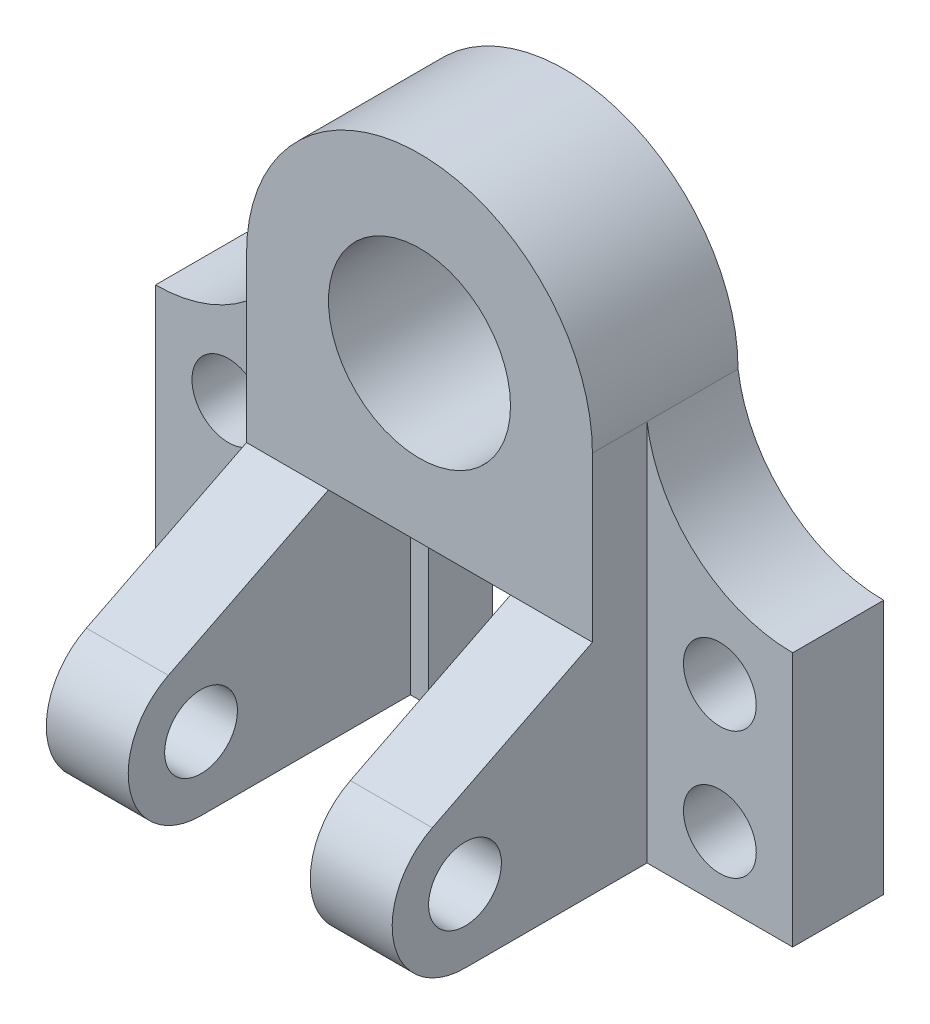
ISO-10303-21;
HEADER;
FILE_DESCRIPTION(('STEP AP214'),'2;1');
FILE_NAME('part.step','',(''),(''),'','','');
FILE_SCHEMA(('AUTOMOTIVE_DESIGN { 1 0 10303 214 1 1 1 1 }'));
ENDSEC;
DATA;
#1=APPLICATION_CONTEXT('core data for automotive mechanical design processes');
#2=APPLICATION_PROTOCOL_DEFINITION('international standard','automotive_design',2000,#1);
#3=PRODUCT_CONTEXT('',#1,'mechanical');
#4=PRODUCT('Part','Part','',(#3));
#5=PRODUCT_RELATED_PRODUCT_CATEGORY('part','',(#4));
#6=PRODUCT_DEFINITION_FORMATION('','',#4);
#7=PRODUCT_DEFINITION_CONTEXT('part definition',#1,'design');
#8=PRODUCT_DEFINITION('design','',#6,#7);
#9=PRODUCT_DEFINITION_SHAPE('','',#8);
#10=(LENGTH_UNIT() NAMED_UNIT(*) SI_UNIT(.MILLI.,.METRE.));
#11=(NAMED_UNIT(*) PLANE_ANGLE_UNIT() SI_UNIT($,.RADIAN.));
#12=(NAMED_UNIT(*) SI_UNIT($,.STERADIAN.) SOLID_ANGLE_UNIT());
#13=UNCERTAINTY_MEASURE_WITH_UNIT(LENGTH_MEASURE(1.E-05),#10,'distance_accuracy_value','');
#14=(GEOMETRIC_REPRESENTATION_CONTEXT(3) GLOBAL_UNCERTAINTY_ASSIGNED_CONTEXT((#13)) GLOBAL_UNIT_ASSIGNED_CONTEXT((#10,
#11,#12)) REPRESENTATION_CONTEXT('',''));
#15=CARTESIAN_POINT('',(0.,0.,0.));
#16=DIRECTION('',(0.,0.,1.));
#17=DIRECTION('',(1.,0.,0.));
#18=AXIS2_PLACEMENT_3D('',#15,#16,#17);
#19=CARTESIAN_POINT('',(-38.,-36.,32.));
#20=DIRECTION('',(0.,1.,0.));
#21=DIRECTION('',(0.,0.,1.));
#22=AXIS2_PLACEMENT_3D('',#19,#20,#21);
#23=PLANE('',#22);
#24=DIRECTION('',(0.,0.,1.));
#25=VECTOR('',#24,1.);
#26=CARTESIAN_POINT('',(16.,-36.,0.));
#27=LINE('',#26,#25);
#28=CARTESIAN_POINT('',(16.,-36.,0.));
#29=VERTEX_POINT('',#28);
#30=CARTESIAN_POINT('',(16.,-36.,14.));
#31=VERTEX_POINT('',#30);
#32=EDGE_CURVE('E48',#29,#31,#27,.T.);
#33=ORIENTED_EDGE('',*,*,#32,.T.);
#34=DIRECTION('',(1.,0.,0.));
#35=VECTOR('',#34,1.);
#36=CARTESIAN_POINT('',(16.,-36.,14.));
#37=LINE('',#36,#35);
#38=CARTESIAN_POINT('',(20.,-36.,14.));
#39=VERTEX_POINT('',#38);
#40=EDGE_CURVE('E199',#31,#39,#37,.T.);
#41=ORIENTED_EDGE('',*,*,#40,.T.);
#42=DIRECTION('',(0.,0.,1.));
#43=VECTOR('',#42,1.);
#44=CARTESIAN_POINT('',(20.,-36.,0.));
#45=LINE('',#44,#43);
#46=CARTESIAN_POINT('',(20.,-36.,32.));
#47=VERTEX_POINT('',#46);
#48=EDGE_CURVE('E219',#39,#47,#45,.T.);
#49=ORIENTED_EDGE('',*,*,#48,.T.);
#50=DIRECTION('',(1.,0.,0.));
#51=VECTOR('',#50,1.);
#52=CARTESIAN_POINT('',(-38.,-36.,32.));
#53=LINE('',#52,#51);
#54=CARTESIAN_POINT('',(-20.,-36.,32.));
#55=VERTEX_POINT('',#54);
#56=EDGE_CURVE('E365',#55,#47,#53,.T.);
#57=ORIENTED_EDGE('',*,*,#56,.F.);
#58=DIRECTION('',(0.,0.,1.));
#59=VECTOR('',#58,1.);
#60=CARTESIAN_POINT('',(-20.,-36.,0.));
#61=LINE('',#60,#59);
#62=CARTESIAN_POINT('',(-20.,-36.,14.));
#63=VERTEX_POINT('',#62);
#64=EDGE_CURVE('E262',#63,#55,#61,.T.);
#65=ORIENTED_EDGE('',*,*,#64,.F.);
#66=DIRECTION('',(-1.,0.,0.));
#67=VECTOR('',#66,1.);
#68=CARTESIAN_POINT('',(-16.,-36.,14.));
#69=LINE('',#68,#67);
#70=CARTESIAN_POINT('',(-16.,-36.,14.));
#71=VERTEX_POINT('',#70);
#72=EDGE_CURVE('E252',#71,#63,#69,.T.);
#73=ORIENTED_EDGE('',*,*,#72,.F.);
#74=DIRECTION('',(0.,0.,1.));
#75=VECTOR('',#74,1.);
#76=CARTESIAN_POINT('',(-16.,-36.,0.));
#77=LINE('',#76,#75);
#78=CARTESIAN_POINT('',(-16.,-36.,0.));
#79=VERTEX_POINT('',#78);
#80=EDGE_CURVE('E239',#79,#71,#77,.T.);
#81=ORIENTED_EDGE('',*,*,#80,.F.);
#82=DIRECTION('',(1.,0.,0.));
#83=VECTOR('',#82,1.);
#84=CARTESIAN_POINT('',(-38.,-36.,0.));
#85=LINE('',#84,#83);
#86=EDGE_CURVE('E53',#79,#29,#85,.T.);
#87=ORIENTED_EDGE('',*,*,#86,.T.);
#88=EDGE_LOOP('',(#33,#41,#49,#57,#65,#73,#81,#87));
#89=FACE_BOUND('',#88,.T.);
#90=ADVANCED_FACE('F33',(#89),#23,.F.);
#91=CARTESIAN_POINT('',(-20.,-68.,60.));
#92=DIRECTION('',(1.,0.,0.));
#93=DIRECTION('',(0.,1.,0.));
#94=AXIS2_PLACEMENT_3D('',#91,#92,#93);
#95=PLANE('',#94);
#96=CARTESIAN_POINT('',(-20.,-68.,60.));
#97=DIRECTION('',(1.,0.,0.));
#98=DIRECTION('',(0.,1.,0.));
#99=AXIS2_PLACEMENT_3D('',#96,#97,#98);
#100=CIRCLE('',#99,8.);
#101=CARTESIAN_POINT('',(-20.,-60.,60.));
#102=VERTEX_POINT('',#101);
#103=EDGE_CURVE('E256',#102,#102,#100,.T.);
#104=ORIENTED_EDGE('',*,*,#103,.F.);
#105=EDGE_LOOP('',(#104));
#106=FACE_BOUND('',#105,.T.);
#107=DIRECTION('',(0.,0.,-1.));
#108=VECTOR('',#107,1.);
#109=CARTESIAN_POINT('',(-20.,-84.,0.));
#110=LINE('',#109,#108);
#111=CARTESIAN_POINT('',(-20.,-84.,60.));
#112=VERTEX_POINT('',#111);
#113=CARTESIAN_POINT('',(-20.,-84.,14.));
#114=VERTEX_POINT('',#113);
#115=EDGE_CURVE('E269',#112,#114,#110,.T.);
#116=ORIENTED_EDGE('',*,*,#115,.T.);
#117=DIRECTION('',(0.,-1.,0.));
#118=VECTOR('',#117,1.);
#119=CARTESIAN_POINT('',(-20.,-36.,14.));
#120=LINE('',#119,#118);
#121=EDGE_CURVE('E235',#63,#114,#120,.T.);
#122=ORIENTED_EDGE('',*,*,#121,.F.);
#123=ORIENTED_EDGE('',*,*,#64,.T.);
#124=DIRECTION('',(0.,-0.449476658534237,0.893292076217458));
#125=VECTOR('',#124,1.);
#126=CARTESIAN_POINT('',(-20.,-36.,32.));
#127=LINE('',#126,#125);
#128=CARTESIAN_POINT('',(-20.,-53.7073267805207,67.1916265365478));
#129=VERTEX_POINT('',#128);
#130=EDGE_CURVE('E264',#55,#129,#127,.T.);
#131=ORIENTED_EDGE('',*,*,#130,.T.);
#132=CARTESIAN_POINT('',(-20.,-68.,60.));
#133=DIRECTION('',(1.,0.,0.));
#134=DIRECTION('',(0.,1.,0.));
#135=AXIS2_PLACEMENT_3D('',#132,#133,#134);
#136=CIRCLE('',#135,16.);
#137=EDGE_CURVE('E267',#129,#112,#136,.T.);
#138=ORIENTED_EDGE('',*,*,#137,.T.);
#139=EDGE_LOOP('',(#116,#122,#123,#131,#138));
#140=FACE_BOUND('',#139,.T.);
#141=ADVANCED_FACE('F426',(#106,#140),#95,.T.);
#142=CARTESIAN_POINT('',(38.,-36.,32.));
#143=DIRECTION('',(-1.,0.,0.));
#144=DIRECTION('',(0.,-1.,0.));
#145=AXIS2_PLACEMENT_3D('',#142,#143,#144);
#146=PLANE('',#145);
#147=DIRECTION('',(0.,1.,0.));
#148=VECTOR('',#147,1.);
#149=CARTESIAN_POINT('',(38.,-36.,32.));
#150=LINE('',#149,#148);
#151=CARTESIAN_POINT('',(38.,-36.,32.));
#152=VERTEX_POINT('',#151);
#153=CARTESIAN_POINT('',(38.,0.,32.));
#154=VERTEX_POINT('',#153);
#155=EDGE_CURVE('E369',#152,#154,#150,.T.);
#156=ORIENTED_EDGE('',*,*,#155,.F.);
#157=DIRECTION('',(0.,-0.449476658534237,0.893292076217458));
#158=VECTOR('',#157,1.);
#159=CARTESIAN_POINT('',(38.,-36.,32.));
#160=LINE('',#159,#158);
#161=CARTESIAN_POINT('',(38.,-53.7073267805207,67.1916265365478));
#162=VERTEX_POINT('',#161);
#163=EDGE_CURVE('E213',#152,#162,#160,.T.);
#164=ORIENTED_EDGE('',*,*,#163,.T.);
#165=CARTESIAN_POINT('',(38.,-68.,60.));
#166=DIRECTION('',(1.,0.,0.));
#167=DIRECTION('',(0.,1.,0.));
#168=AXIS2_PLACEMENT_3D('',#165,#166,#167);
#169=CIRCLE('',#168,16.);
#170=CARTESIAN_POINT('',(38.,-84.,60.));
#171=VERTEX_POINT('',#170);
#172=EDGE_CURVE('E224',#162,#171,#169,.T.);
#173=ORIENTED_EDGE('',*,*,#172,.T.);
#174=DIRECTION('',(0.,0.,-1.));
#175=VECTOR('',#174,1.);
#176=CARTESIAN_POINT('',(38.,-84.,0.));
#177=LINE('',#176,#175);
#178=CARTESIAN_POINT('',(38.,-84.,20.));
#179=VERTEX_POINT('',#178);
#180=EDGE_CURVE('E207',#171,#179,#177,.T.);
#181=ORIENTED_EDGE('',*,*,#180,.T.);
#182=DIRECTION('',(0.,-1.,0.));
#183=VECTOR('',#182,1.);
#184=CARTESIAN_POINT('',(38.,0.,20.));
#185=LINE('',#184,#183);
#186=CARTESIAN_POINT('',(38.,0.,20.));
#187=VERTEX_POINT('',#186);
#188=EDGE_CURVE('E306',#187,#179,#185,.T.);
#189=ORIENTED_EDGE('',*,*,#188,.F.);
#190=DIRECTION('',(0.,0.,-1.));
#191=VECTOR('',#190,1.);
#192=CARTESIAN_POINT('',(38.,0.,32.));
#193=LINE('',#192,#191);
#194=EDGE_CURVE('E41',#154,#187,#193,.T.);
#195=ORIENTED_EDGE('',*,*,#194,.F.);
#196=EDGE_LOOP('',(#156,#164,#173,#181,#189,#195));
#197=FACE_BOUND('',#196,.T.);
#198=CARTESIAN_POINT('',(38.,-68.,60.));
#199=DIRECTION('',(1.,0.,0.));
#200=DIRECTION('',(0.,1.,0.));
#201=AXIS2_PLACEMENT_3D('',#198,#199,#200);
#202=CIRCLE('',#201,8.);
#203=CARTESIAN_POINT('',(38.,-60.,60.));
#204=VERTEX_POINT('',#203);
#205=EDGE_CURVE('E203',#204,#204,#202,.T.);
#206=ORIENTED_EDGE('',*,*,#205,.F.);
#207=EDGE_LOOP('',(#206));
#208=FACE_BOUND('',#207,.T.);
#209=ADVANCED_FACE('F392',(#197,#208),#146,.F.);
#210=CARTESIAN_POINT('',(-38.,0.,32.));
#211=DIRECTION('',(1.,0.,0.));
#212=DIRECTION('',(0.,1.,0.));
#213=AXIS2_PLACEMENT_3D('',#210,#211,#212);
#214=PLANE('',#213);
#215=DIRECTION('',(0.,-1.,0.));
#216=VECTOR('',#215,1.);
#217=CARTESIAN_POINT('',(-38.,0.,20.));
#218=LINE('',#217,#216);
#219=CARTESIAN_POINT('',(-38.,0.,20.));
#220=VERTEX_POINT('',#219);
#221=CARTESIAN_POINT('',(-38.,-84.,20.));
#222=VERTEX_POINT('',#221);
#223=EDGE_CURVE('E343',#220,#222,#218,.T.);
#224=ORIENTED_EDGE('',*,*,#223,.T.);
#225=DIRECTION('',(0.,0.,-1.));
#226=VECTOR('',#225,1.);
#227=CARTESIAN_POINT('',(-38.,-84.,0.));
#228=LINE('',#227,#226);
#229=CARTESIAN_POINT('',(-38.,-84.,60.));
#230=VERTEX_POINT('',#229);
#231=EDGE_CURVE('E265',#230,#222,#228,.T.);
#232=ORIENTED_EDGE('',*,*,#231,.F.);
#233=CARTESIAN_POINT('',(-38.,-68.,60.));
#234=DIRECTION('',(1.,0.,0.));
#235=DIRECTION('',(0.,1.,0.));
#236=AXIS2_PLACEMENT_3D('',#233,#234,#235);
#237=CIRCLE('',#236,16.);
#238=CARTESIAN_POINT('',(-38.,-53.7073267805207,67.1916265365478));
#239=VERTEX_POINT('',#238);
#240=EDGE_CURVE('E273',#239,#230,#237,.T.);
#241=ORIENTED_EDGE('',*,*,#240,.F.);
#242=DIRECTION('',(0.,-0.449476658534237,0.893292076217458));
#243=VECTOR('',#242,1.);
#244=CARTESIAN_POINT('',(-38.,-36.,32.));
#245=LINE('',#244,#243);
#246=CARTESIAN_POINT('',(-38.,-36.,32.));
#247=VERTEX_POINT('',#246);
#248=EDGE_CURVE('E259',#247,#239,#245,.T.);
#249=ORIENTED_EDGE('',*,*,#248,.F.);
#250=DIRECTION('',(0.,-1.,0.));
#251=VECTOR('',#250,1.);
#252=CARTESIAN_POINT('',(-38.,0.,32.));
#253=LINE('',#252,#251);
#254=CARTESIAN_POINT('',(-38.,0.,32.));
#255=VERTEX_POINT('',#254);
#256=EDGE_CURVE('E363',#255,#247,#253,.T.);
#257=ORIENTED_EDGE('',*,*,#256,.F.);
#258=DIRECTION('',(0.,0.,-1.));
#259=VECTOR('',#258,1.);
#260=CARTESIAN_POINT('',(-38.,0.,32.));
#261=LINE('',#260,#259);
#262=EDGE_CURVE('E11',#255,#220,#261,.T.);
#263=ORIENTED_EDGE('',*,*,#262,.T.);
#264=EDGE_LOOP('',(#224,#232,#241,#249,#257,#263));
#265=FACE_BOUND('',#264,.T.);
#266=CARTESIAN_POINT('',(-38.,-68.,60.));
#267=DIRECTION('',(1.,0.,0.));
#268=DIRECTION('',(0.,1.,0.));
#269=AXIS2_PLACEMENT_3D('',#266,#267,#268);
#270=CIRCLE('',#269,8.);
#271=CARTESIAN_POINT('',(-38.,-60.,60.));
#272=VERTEX_POINT('',#271);
#273=EDGE_CURVE('E255',#272,#272,#270,.T.);
#274=ORIENTED_EDGE('',*,*,#273,.T.);
#275=EDGE_LOOP('',(#274));
#276=FACE_BOUND('',#275,.T.);
#277=ADVANCED_FACE('F435',(#265,#276),#214,.F.);
#278=CARTESIAN_POINT('',(0.,0.,32.));
#279=DIRECTION('',(0.,0.,1.));
#280=DIRECTION('',(1.,0.,0.));
#281=AXIS2_PLACEMENT_3D('',#278,#279,#280);
#282=PLANE('',#281);
#283=CARTESIAN_POINT('',(0.,0.,32.));
#284=DIRECTION('',(0.,0.,1.));
#285=DIRECTION('',(1.,0.,0.));
#286=AXIS2_PLACEMENT_3D('',#283,#284,#285);
#287=CIRCLE('',#286,38.);
#288=EDGE_CURVE('E360',#154,#255,#287,.T.);
#289=ORIENTED_EDGE('',*,*,#288,.T.);
#290=ORIENTED_EDGE('',*,*,#256,.T.);
#291=EDGE_CURVE('E366',#247,#55,#53,.T.);
#292=ORIENTED_EDGE('',*,*,#291,.T.);
#293=ORIENTED_EDGE('',*,*,#56,.T.);
#294=DIRECTION('',(1.,0.,0.));
#295=VECTOR('',#294,1.);
#296=CARTESIAN_POINT('',(20.,-36.,32.));
#297=LINE('',#296,#295);
#298=EDGE_CURVE('E221',#47,#152,#297,.T.);
#299=ORIENTED_EDGE('',*,*,#298,.T.);
#300=ORIENTED_EDGE('',*,*,#155,.T.);
#301=EDGE_LOOP('',(#289,#290,#292,#293,#299,#300));
#302=FACE_BOUND('',#301,.T.);
#303=CARTESIAN_POINT('',(0.,0.,32.));
#304=DIRECTION('',(0.,0.,1.));
#305=DIRECTION('',(1.,0.,0.));
#306=AXIS2_PLACEMENT_3D('',#303,#304,#305);
#307=CIRCLE('',#306,20.);
#308=CARTESIAN_POINT('',(20.,0.,32.));
#309=VERTEX_POINT('',#308);
#310=EDGE_CURVE('E354',#309,#309,#307,.T.);
#311=ORIENTED_EDGE('',*,*,#310,.F.);
#312=EDGE_LOOP('',(#311));
#313=FACE_BOUND('',#312,.T.);
#314=ADVANCED_FACE('F406',(#302,#313),#282,.T.);
#315=CARTESIAN_POINT('',(0.,0.,0.));
#316=DIRECTION('',(0.,0.,1.));
#317=DIRECTION('',(1.,0.,0.));
#318=AXIS2_PLACEMENT_3D('',#315,#316,#317);
#319=PLANE('',#318);
#320=ORIENTED_EDGE('',*,*,#86,.F.);
#321=DIRECTION('',(0.,1.,0.));
#322=VECTOR('',#321,1.);
#323=CARTESIAN_POINT('',(-16.,-84.,0.));
#324=LINE('',#323,#322);
#325=CARTESIAN_POINT('',(-16.,-84.,0.));
#326=VERTEX_POINT('',#325);
#327=EDGE_CURVE('E236',#326,#79,#324,.T.);
#328=ORIENTED_EDGE('',*,*,#327,.F.);
#329=DIRECTION('',(1.,0.,0.));
#330=VECTOR('',#329,1.);
#331=CARTESIAN_POINT('',(-38.,-84.,0.));
#332=LINE('',#331,#330);
#333=CARTESIAN_POINT('',(-70.,-84.,0.));
#334=VERTEX_POINT('',#333);
#335=EDGE_CURVE('E331',#334,#326,#332,.T.);
#336=ORIENTED_EDGE('',*,*,#335,.F.);
#337=DIRECTION('',(0.,-1.,0.));
#338=VECTOR('',#337,1.);
#339=CARTESIAN_POINT('',(-70.,-84.,0.));
#340=LINE('',#339,#338);
#341=CARTESIAN_POINT('',(-69.9999999999997,-28.,0.));
#342=VERTEX_POINT('',#341);
#343=EDGE_CURVE('E327',#342,#334,#340,.T.);
#344=ORIENTED_EDGE('',*,*,#343,.F.);
#345=CARTESIAN_POINT('',(-70.,4.28571428571427,0.));
#346=DIRECTION('',(0.,0.,1.));
#347=DIRECTION('',(1.,0.,0.));
#348=AXIS2_PLACEMENT_3D('',#345,#346,#347);
#349=CIRCLE('',#348,32.2857142857143);
#350=CARTESIAN_POINT('',(-38.,0.,0.));
#351=VERTEX_POINT('',#350);
#352=EDGE_CURVE('E339',#342,#351,#349,.T.);
#353=ORIENTED_EDGE('',*,*,#352,.T.);
#354=CARTESIAN_POINT('',(0.,0.,0.));
#355=DIRECTION('',(0.,0.,1.));
#356=DIRECTION('',(1.,0.,0.));
#357=AXIS2_PLACEMENT_3D('',#354,#355,#356);
#358=CIRCLE('',#357,38.);
#359=CARTESIAN_POINT('',(38.,0.,0.));
#360=VERTEX_POINT('',#359);
#361=EDGE_CURVE('E357',#360,#351,#358,.T.);
#362=ORIENTED_EDGE('',*,*,#361,.F.);
#363=CARTESIAN_POINT('',(70.,4.28571428571427,0.));
#364=DIRECTION('',(0.,0.,-1.));
#365=DIRECTION('',(-1.,0.,0.));
#366=AXIS2_PLACEMENT_3D('',#363,#364,#365);
#367=CIRCLE('',#366,32.2857142857143);
#368=CARTESIAN_POINT('',(70.,-28.,0.));
#369=VERTEX_POINT('',#368);
#370=EDGE_CURVE('E302',#369,#360,#367,.T.);
#371=ORIENTED_EDGE('',*,*,#370,.F.);
#372=DIRECTION('',(0.,-1.,0.));
#373=VECTOR('',#372,1.);
#374=CARTESIAN_POINT('',(70.,-84.,0.));
#375=LINE('',#374,#373);
#376=CARTESIAN_POINT('',(70.,-84.,0.));
#377=VERTEX_POINT('',#376);
#378=EDGE_CURVE('E177',#369,#377,#375,.T.);
#379=ORIENTED_EDGE('',*,*,#378,.T.);
#380=DIRECTION('',(-1.,0.,0.));
#381=VECTOR('',#380,1.);
#382=CARTESIAN_POINT('',(38.,-84.,0.));
#383=LINE('',#382,#381);
#384=CARTESIAN_POINT('',(16.,-84.,0.));
#385=VERTEX_POINT('',#384);
#386=EDGE_CURVE('E170',#377,#385,#383,.T.);
#387=ORIENTED_EDGE('',*,*,#386,.T.);
#388=DIRECTION('',(0.,1.,0.));
#389=VECTOR('',#388,1.);
#390=CARTESIAN_POINT('',(16.,-84.,0.));
#391=LINE('',#390,#389);
#392=EDGE_CURVE('E174',#385,#29,#391,.T.);
#393=ORIENTED_EDGE('',*,*,#392,.T.);
#394=EDGE_LOOP('',(#320,#328,#336,#344,#353,#362,#371,#379,#387,#393));
#395=FACE_BOUND('',#394,.T.);
#396=CARTESIAN_POINT('',(53.9999999999998,-70.,0.));
#397=DIRECTION('',(0.,0.,1.));
#398=DIRECTION('',(1.,0.,0.));
#399=AXIS2_PLACEMENT_3D('',#396,#397,#398);
#400=CIRCLE('',#399,7.99999999999999);
#401=CARTESIAN_POINT('',(61.9999999999998,-70.,0.));
#402=VERTEX_POINT('',#401);
#403=EDGE_CURVE('E285',#402,#402,#400,.T.);
#404=ORIENTED_EDGE('',*,*,#403,.T.);
#405=EDGE_LOOP('',(#404));
#406=FACE_BOUND('',#405,.T.);
#407=CARTESIAN_POINT('',(53.9999999999997,-42.,0.));
#408=DIRECTION('',(0.,0.,1.));
#409=DIRECTION('',(1.,0.,0.));
#410=AXIS2_PLACEMENT_3D('',#407,#408,#409);
#411=CIRCLE('',#410,7.99999999999999);
#412=CARTESIAN_POINT('',(61.9999999999997,-42.,0.));
#413=VERTEX_POINT('',#412);
#414=EDGE_CURVE('E180',#413,#413,#411,.T.);
#415=ORIENTED_EDGE('',*,*,#414,.T.);
#416=EDGE_LOOP('',(#415));
#417=FACE_BOUND('',#416,.T.);
#418=CARTESIAN_POINT('',(-53.9999999999998,-70.,0.));
#419=DIRECTION('',(0.,0.,1.));
#420=DIRECTION('',(1.,0.,0.));
#421=AXIS2_PLACEMENT_3D('',#418,#419,#420);
#422=CIRCLE('',#421,7.99999999999999);
#423=CARTESIAN_POINT('',(-45.9999999999998,-70.,0.));
#424=VERTEX_POINT('',#423);
#425=EDGE_CURVE('E314',#424,#424,#422,.T.);
#426=ORIENTED_EDGE('',*,*,#425,.T.);
#427=EDGE_LOOP('',(#426));
#428=FACE_BOUND('',#427,.T.);
#429=CARTESIAN_POINT('',(-53.9999999999997,-42.,0.));
#430=DIRECTION('',(0.,0.,1.));
#431=DIRECTION('',(1.,0.,0.));
#432=AXIS2_PLACEMENT_3D('',#429,#430,#431);
#433=CIRCLE('',#432,7.99999999999999);
#434=CARTESIAN_POINT('',(-45.9999999999997,-42.,0.));
#435=VERTEX_POINT('',#434);
#436=EDGE_CURVE('E324',#435,#435,#433,.T.);
#437=ORIENTED_EDGE('',*,*,#436,.T.);
#438=EDGE_LOOP('',(#437));
#439=FACE_BOUND('',#438,.T.);
#440=CARTESIAN_POINT('',(0.,0.,0.));
#441=DIRECTION('',(0.,0.,1.));
#442=DIRECTION('',(1.,0.,0.));
#443=AXIS2_PLACEMENT_3D('',#440,#441,#442);
#444=CIRCLE('',#443,20.);
#445=CARTESIAN_POINT('',(20.,0.,0.));
#446=VERTEX_POINT('',#445);
#447=EDGE_CURVE('E351',#446,#446,#444,.T.);
#448=ORIENTED_EDGE('',*,*,#447,.T.);
#449=EDGE_LOOP('',(#448));
#450=FACE_BOUND('',#449,.T.);
#451=ADVANCED_FACE('F172',(#395,#406,#417,#428,#439,#450),#319,.F.);
#452=CARTESIAN_POINT('',(0.,0.,32.));
#453=DIRECTION('',(0.,0.,-1.));
#454=DIRECTION('',(-1.,0.,0.));
#455=AXIS2_PLACEMENT_3D('',#452,#453,#454);
#456=CYLINDRICAL_SURFACE('',#455,38.);
#457=ORIENTED_EDGE('',*,*,#361,.T.);
#458=DIRECTION('',(0.,0.,-1.));
#459=VECTOR('',#458,1.);
#460=CARTESIAN_POINT('',(-38.,0.,20.));
#461=LINE('',#460,#459);
#462=EDGE_CURVE('E345',#220,#351,#461,.T.);
#463=ORIENTED_EDGE('',*,*,#462,.F.);
#464=ORIENTED_EDGE('',*,*,#262,.F.);
#465=ORIENTED_EDGE('',*,*,#288,.F.);
#466=ORIENTED_EDGE('',*,*,#194,.T.);
#467=DIRECTION('',(0.,0.,-1.));
#468=VECTOR('',#467,1.);
#469=CARTESIAN_POINT('',(38.,0.,20.));
#470=LINE('',#469,#468);
#471=EDGE_CURVE('E311',#187,#360,#470,.T.);
#472=ORIENTED_EDGE('',*,*,#471,.T.);
#473=EDGE_LOOP('',(#457,#463,#464,#465,#466,#472));
#474=FACE_BOUND('',#473,.T.);
#475=ADVANCED_FACE('F35',(#474),#456,.T.);
#476=CARTESIAN_POINT('',(0.,0.,32.));
#477=DIRECTION('',(0.,0.,-1.));
#478=DIRECTION('',(-1.,0.,0.));
#479=AXIS2_PLACEMENT_3D('',#476,#477,#478);
#480=CYLINDRICAL_SURFACE('',#479,20.);
#481=ORIENTED_EDGE('',*,*,#310,.T.);
#482=EDGE_LOOP('',(#481));
#483=FACE_BOUND('',#482,.T.);
#484=ORIENTED_EDGE('',*,*,#447,.F.);
#485=EDGE_LOOP('',(#484));
#486=FACE_BOUND('',#485,.T.);
#487=ADVANCED_FACE('F509',(#483,#486),#480,.F.);
#488=CARTESIAN_POINT('',(-70.,4.28571428571427,20.));
#489=DIRECTION('',(0.,0.,-1.));
#490=DIRECTION('',(-1.,0.,0.));
#491=AXIS2_PLACEMENT_3D('',#488,#489,#490);
#492=CYLINDRICAL_SURFACE('',#491,32.2857142857143);
#493=ORIENTED_EDGE('',*,*,#352,.F.);
#494=DIRECTION('',(0.,0.,-1.));
#495=VECTOR('',#494,1.);
#496=CARTESIAN_POINT('',(-70.,-28.,20.));
#497=LINE('',#496,#495);
#498=CARTESIAN_POINT('',(-69.9999999999997,-28.,20.));
#499=VERTEX_POINT('',#498);
#500=EDGE_CURVE('E348',#499,#342,#497,.T.);
#501=ORIENTED_EDGE('',*,*,#500,.F.);
#502=CARTESIAN_POINT('',(-70.,4.28571428571427,20.));
#503=DIRECTION('',(0.,0.,1.));
#504=DIRECTION('',(1.,0.,0.));
#505=AXIS2_PLACEMENT_3D('',#502,#503,#504);
#506=CIRCLE('',#505,32.2857142857143);
#507=EDGE_CURVE('E340',#499,#220,#506,.T.);
#508=ORIENTED_EDGE('',*,*,#507,.T.);
#509=ORIENTED_EDGE('',*,*,#462,.T.);
#510=EDGE_LOOP('',(#493,#501,#508,#509));
#511=FACE_BOUND('',#510,.T.);
#512=ADVANCED_FACE('F505',(#511),#492,.F.);
#513=CARTESIAN_POINT('',(-70.,4.28571428571427,20.));
#514=DIRECTION('',(0.,0.,1.));
#515=DIRECTION('',(1.,0.,0.));
#516=AXIS2_PLACEMENT_3D('',#513,#514,#515);
#517=PLANE('',#516);
#518=CARTESIAN_POINT('',(-53.9999999999998,-70.,20.));
#519=DIRECTION('',(0.,0.,1.));
#520=DIRECTION('',(1.,0.,0.));
#521=AXIS2_PLACEMENT_3D('',#518,#519,#520);
#522=CIRCLE('',#521,7.99999999999999);
#523=CARTESIAN_POINT('',(-45.9999999999998,-70.,20.));
#524=VERTEX_POINT('',#523);
#525=EDGE_CURVE('E318',#524,#524,#522,.T.);
#526=ORIENTED_EDGE('',*,*,#525,.F.);
#527=EDGE_LOOP('',(#526));
#528=FACE_BOUND('',#527,.T.);
#529=CARTESIAN_POINT('',(-53.9999999999997,-42.,20.));
#530=DIRECTION('',(0.,0.,1.));
#531=DIRECTION('',(1.,0.,0.));
#532=AXIS2_PLACEMENT_3D('',#529,#530,#531);
#533=CIRCLE('',#532,7.99999999999999);
#534=CARTESIAN_POINT('',(-45.9999999999997,-42.,20.));
#535=VERTEX_POINT('',#534);
#536=EDGE_CURVE('E321',#535,#535,#533,.T.);
#537=ORIENTED_EDGE('',*,*,#536,.F.);
#538=EDGE_LOOP('',(#537));
#539=FACE_BOUND('',#538,.T.);
#540=ORIENTED_EDGE('',*,*,#507,.F.);
#541=DIRECTION('',(0.,-1.,0.));
#542=VECTOR('',#541,1.);
#543=CARTESIAN_POINT('',(-70.,-84.,20.));
#544=LINE('',#543,#542);
#545=CARTESIAN_POINT('',(-70.,-84.,20.));
#546=VERTEX_POINT('',#545);
#547=EDGE_CURVE('E328',#499,#546,#544,.T.);
#548=ORIENTED_EDGE('',*,*,#547,.T.);
#549=DIRECTION('',(1.,0.,0.));
#550=VECTOR('',#549,1.);
#551=CARTESIAN_POINT('',(-38.,-84.,20.));
#552=LINE('',#551,#550);
#553=EDGE_CURVE('E330',#546,#222,#552,.T.);
#554=ORIENTED_EDGE('',*,*,#553,.T.);
#555=ORIENTED_EDGE('',*,*,#223,.F.);
#556=EDGE_LOOP('',(#540,#548,#554,#555));
#557=FACE_BOUND('',#556,.T.);
#558=ADVANCED_FACE('F501',(#528,#539,#557),#517,.T.);
#559=CARTESIAN_POINT('',(-70.,-84.,20.));
#560=DIRECTION('',(1.,0.,0.));
#561=DIRECTION('',(0.,1.,0.));
#562=AXIS2_PLACEMENT_3D('',#559,#560,#561);
#563=PLANE('',#562);
#564=ORIENTED_EDGE('',*,*,#343,.T.);
#565=DIRECTION('',(0.,0.,-1.));
#566=VECTOR('',#565,1.);
#567=CARTESIAN_POINT('',(-70.,-84.,20.));
#568=LINE('',#567,#566);
#569=EDGE_CURVE('E334',#546,#334,#568,.T.);
#570=ORIENTED_EDGE('',*,*,#569,.F.);
#571=ORIENTED_EDGE('',*,*,#547,.F.);
#572=ORIENTED_EDGE('',*,*,#500,.T.);
#573=EDGE_LOOP('',(#564,#570,#571,#572));
#574=FACE_BOUND('',#573,.T.);
#575=ADVANCED_FACE('F497',(#574),#563,.F.);
#576=CARTESIAN_POINT('',(-38.,-84.,20.));
#577=DIRECTION('',(0.,1.,0.));
#578=DIRECTION('',(0.,0.,1.));
#579=AXIS2_PLACEMENT_3D('',#576,#577,#578);
#580=PLANE('',#579);
#581=ORIENTED_EDGE('',*,*,#335,.T.);
#582=DIRECTION('',(0.,0.,-1.));
#583=VECTOR('',#582,1.);
#584=CARTESIAN_POINT('',(-16.,-84.,0.));
#585=LINE('',#584,#583);
#586=CARTESIAN_POINT('',(-16.,-84.,14.));
#587=VERTEX_POINT('',#586);
#588=EDGE_CURVE('E244',#587,#326,#585,.T.);
#589=ORIENTED_EDGE('',*,*,#588,.F.);
#590=DIRECTION('',(-1.,0.,0.));
#591=VECTOR('',#590,1.);
#592=CARTESIAN_POINT('',(-16.,-84.,14.));
#593=LINE('',#592,#591);
#594=EDGE_CURVE('E247',#587,#114,#593,.T.);
#595=ORIENTED_EDGE('',*,*,#594,.T.);
#596=ORIENTED_EDGE('',*,*,#115,.F.);
#597=DIRECTION('',(-1.,0.,0.));
#598=VECTOR('',#597,1.);
#599=CARTESIAN_POINT('',(-20.,-84.,60.));
#600=LINE('',#599,#598);
#601=EDGE_CURVE('E271',#112,#230,#600,.T.);
#602=ORIENTED_EDGE('',*,*,#601,.T.);
#603=ORIENTED_EDGE('',*,*,#231,.T.);
#604=ORIENTED_EDGE('',*,*,#553,.F.);
#605=ORIENTED_EDGE('',*,*,#569,.T.);
#606=EDGE_LOOP('',(#581,#589,#595,#596,#602,#603,#604,#605));
#607=FACE_BOUND('',#606,.T.);
#608=ADVANCED_FACE('F493',(#607),#580,.F.);
#609=CARTESIAN_POINT('',(-53.9999999999997,-42.,20.));
#610=DIRECTION('',(0.,0.,1.));
#611=DIRECTION('',(1.,0.,0.));
#612=AXIS2_PLACEMENT_3D('',#609,#610,#611);
#613=CYLINDRICAL_SURFACE('',#612,7.99999999999999);
#614=ORIENTED_EDGE('',*,*,#436,.F.);
#615=EDGE_LOOP('',(#614));
#616=FACE_BOUND('',#615,.T.);
#617=ORIENTED_EDGE('',*,*,#536,.T.);
#618=EDGE_LOOP('',(#617));
#619=FACE_BOUND('',#618,.T.);
#620=ADVANCED_FACE('F489',(#616,#619),#613,.F.);
#621=CARTESIAN_POINT('',(-53.9999999999998,-70.,20.));
#622=DIRECTION('',(0.,0.,1.));
#623=DIRECTION('',(1.,0.,0.));
#624=AXIS2_PLACEMENT_3D('',#621,#622,#623);
#625=CYLINDRICAL_SURFACE('',#624,7.99999999999999);
#626=ORIENTED_EDGE('',*,*,#425,.F.);
#627=EDGE_LOOP('',(#626));
#628=FACE_BOUND('',#627,.T.);
#629=ORIENTED_EDGE('',*,*,#525,.T.);
#630=EDGE_LOOP('',(#629));
#631=FACE_BOUND('',#630,.T.);
#632=ADVANCED_FACE('F486',(#628,#631),#625,.F.);
#633=CARTESIAN_POINT('',(70.,4.28571428571427,20.));
#634=DIRECTION('',(0.,0.,-1.));
#635=DIRECTION('',(-1.,0.,0.));
#636=AXIS2_PLACEMENT_3D('',#633,#634,#635);
#637=CYLINDRICAL_SURFACE('',#636,32.2857142857143);
#638=ORIENTED_EDGE('',*,*,#370,.T.);
#639=ORIENTED_EDGE('',*,*,#471,.F.);
#640=CARTESIAN_POINT('',(70.,4.28571428571427,20.));
#641=DIRECTION('',(0.,0.,-1.));
#642=DIRECTION('',(-1.,0.,0.));
#643=AXIS2_PLACEMENT_3D('',#640,#641,#642);
#644=CIRCLE('',#643,32.2857142857143);
#645=CARTESIAN_POINT('',(70.,-28.,20.));
#646=VERTEX_POINT('',#645);
#647=EDGE_CURVE('E303',#646,#187,#644,.T.);
#648=ORIENTED_EDGE('',*,*,#647,.F.);
#649=DIRECTION('',(0.,0.,-1.));
#650=VECTOR('',#649,1.);
#651=CARTESIAN_POINT('',(70.,-28.,20.));
#652=LINE('',#651,#650);
#653=EDGE_CURVE('E308',#646,#369,#652,.T.);
#654=ORIENTED_EDGE('',*,*,#653,.T.);
#655=EDGE_LOOP('',(#638,#639,#648,#654));
#656=FACE_BOUND('',#655,.T.);
#657=ADVANCED_FACE('F386',(#656),#637,.F.);
#658=CARTESIAN_POINT('',(70.,4.28571428571427,20.));
#659=DIRECTION('',(0.,0.,1.));
#660=DIRECTION('',(-1.,0.,0.));
#661=AXIS2_PLACEMENT_3D('',#658,#659,#660);
#662=PLANE('',#661);
#663=CARTESIAN_POINT('',(53.9999999999998,-70.,20.));
#664=DIRECTION('',(0.,0.,1.));
#665=DIRECTION('',(1.,0.,0.));
#666=AXIS2_PLACEMENT_3D('',#663,#664,#665);
#667=CIRCLE('',#666,7.99999999999999);
#668=CARTESIAN_POINT('',(61.9999999999998,-70.,20.));
#669=VERTEX_POINT('',#668);
#670=EDGE_CURVE('E282',#669,#669,#667,.T.);
#671=ORIENTED_EDGE('',*,*,#670,.F.);
#672=EDGE_LOOP('',(#671));
#673=FACE_BOUND('',#672,.T.);
#674=CARTESIAN_POINT('',(53.9999999999997,-42.,20.));
#675=DIRECTION('',(0.,0.,1.));
#676=DIRECTION('',(1.,0.,0.));
#677=AXIS2_PLACEMENT_3D('',#674,#675,#676);
#678=CIRCLE('',#677,7.99999999999999);
#679=CARTESIAN_POINT('',(61.9999999999996,-42.,20.));
#680=VERTEX_POINT('',#679);
#681=EDGE_CURVE('E288',#680,#680,#678,.T.);
#682=ORIENTED_EDGE('',*,*,#681,.F.);
#683=EDGE_LOOP('',(#682));
#684=FACE_BOUND('',#683,.T.);
#685=ORIENTED_EDGE('',*,*,#647,.T.);
#686=ORIENTED_EDGE('',*,*,#188,.T.);
#687=DIRECTION('',(-1.,0.,0.));
#688=VECTOR('',#687,1.);
#689=CARTESIAN_POINT('',(38.,-84.,20.));
#690=LINE('',#689,#688);
#691=CARTESIAN_POINT('',(70.,-84.,20.));
#692=VERTEX_POINT('',#691);
#693=EDGE_CURVE('E293',#692,#179,#690,.T.);
#694=ORIENTED_EDGE('',*,*,#693,.F.);
#695=DIRECTION('',(0.,-1.,0.));
#696=VECTOR('',#695,1.);
#697=CARTESIAN_POINT('',(70.,-84.,20.));
#698=LINE('',#697,#696);
#699=EDGE_CURVE('E296',#646,#692,#698,.T.);
#700=ORIENTED_EDGE('',*,*,#699,.F.);
#701=EDGE_LOOP('',(#685,#686,#694,#700));
#702=FACE_BOUND('',#701,.T.);
#703=ADVANCED_FACE('F382',(#673,#684,#702),#662,.T.);
#704=CARTESIAN_POINT('',(38.,-84.,20.));
#705=DIRECTION('',(0.,-1.,0.));
#706=DIRECTION('',(0.,0.,-1.));
#707=AXIS2_PLACEMENT_3D('',#704,#705,#706);
#708=PLANE('',#707);
#709=ORIENTED_EDGE('',*,*,#386,.F.);
#710=DIRECTION('',(0.,0.,-1.));
#711=VECTOR('',#710,1.);
#712=CARTESIAN_POINT('',(70.,-84.,20.));
#713=LINE('',#712,#711);
#714=EDGE_CURVE('E298',#692,#377,#713,.T.);
#715=ORIENTED_EDGE('',*,*,#714,.F.);
#716=ORIENTED_EDGE('',*,*,#693,.T.);
#717=ORIENTED_EDGE('',*,*,#180,.F.);
#718=DIRECTION('',(1.,0.,0.));
#719=VECTOR('',#718,1.);
#720=CARTESIAN_POINT('',(20.,-84.,60.));
#721=LINE('',#720,#719);
#722=CARTESIAN_POINT('',(20.,-84.,60.));
#723=VERTEX_POINT('',#722);
#724=EDGE_CURVE('E233',#723,#171,#721,.T.);
#725=ORIENTED_EDGE('',*,*,#724,.F.);
#726=DIRECTION('',(0.,0.,-1.));
#727=VECTOR('',#726,1.);
#728=CARTESIAN_POINT('',(20.,-84.,0.));
#729=LINE('',#728,#727);
#730=CARTESIAN_POINT('',(20.,-84.,14.));
#731=VERTEX_POINT('',#730);
#732=EDGE_CURVE('E210',#723,#731,#729,.T.);
#733=ORIENTED_EDGE('',*,*,#732,.T.);
#734=DIRECTION('',(1.,0.,0.));
#735=VECTOR('',#734,1.);
#736=CARTESIAN_POINT('',(16.,-84.,14.));
#737=LINE('',#736,#735);
#738=CARTESIAN_POINT('',(16.,-84.,14.));
#739=VERTEX_POINT('',#738);
#740=EDGE_CURVE('E193',#739,#731,#737,.T.);
#741=ORIENTED_EDGE('',*,*,#740,.F.);
#742=DIRECTION('',(0.,0.,-1.));
#743=VECTOR('',#742,1.);
#744=CARTESIAN_POINT('',(16.,-84.,0.));
#745=LINE('',#744,#743);
#746=EDGE_CURVE('E186',#739,#385,#745,.T.);
#747=ORIENTED_EDGE('',*,*,#746,.T.);
#748=EDGE_LOOP('',(#709,#715,#716,#717,#725,#733,#741,#747));
#749=FACE_BOUND('',#748,.T.);
#750=ADVANCED_FACE('F190',(#749),#708,.T.);
#751=CARTESIAN_POINT('',(70.,-84.,20.));
#752=DIRECTION('',(1.,0.,0.));
#753=DIRECTION('',(0.,1.,0.));
#754=AXIS2_PLACEMENT_3D('',#751,#752,#753);
#755=PLANE('',#754);
#756=ORIENTED_EDGE('',*,*,#378,.F.);
#757=ORIENTED_EDGE('',*,*,#653,.F.);
#758=ORIENTED_EDGE('',*,*,#699,.T.);
#759=ORIENTED_EDGE('',*,*,#714,.T.);
#760=EDGE_LOOP('',(#756,#757,#758,#759));
#761=FACE_BOUND('',#760,.T.);
#762=ADVANCED_FACE('F388',(#761),#755,.T.);
#763=CARTESIAN_POINT('',(53.9999999999997,-42.,20.));
#764=DIRECTION('',(0.,0.,1.));
#765=DIRECTION('',(1.,0.,0.));
#766=AXIS2_PLACEMENT_3D('',#763,#764,#765);
#767=CYLINDRICAL_SURFACE('',#766,7.99999999999999);
#768=ORIENTED_EDGE('',*,*,#414,.F.);
#769=EDGE_LOOP('',(#768));
#770=FACE_BOUND('',#769,.T.);
#771=ORIENTED_EDGE('',*,*,#681,.T.);
#772=EDGE_LOOP('',(#771));
#773=FACE_BOUND('',#772,.T.);
#774=ADVANCED_FACE('F472',(#770,#773),#767,.F.);
#775=CARTESIAN_POINT('',(53.9999999999998,-70.,20.));
#776=DIRECTION('',(0.,0.,1.));
#777=DIRECTION('',(1.,0.,0.));
#778=AXIS2_PLACEMENT_3D('',#775,#776,#777);
#779=CYLINDRICAL_SURFACE('',#778,7.99999999999999);
#780=ORIENTED_EDGE('',*,*,#403,.F.);
#781=EDGE_LOOP('',(#780));
#782=FACE_BOUND('',#781,.T.);
#783=ORIENTED_EDGE('',*,*,#670,.T.);
#784=EDGE_LOOP('',(#783));
#785=FACE_BOUND('',#784,.T.);
#786=ADVANCED_FACE('F468',(#782,#785),#779,.F.);
#787=CARTESIAN_POINT('',(-20.,-36.,32.));
#788=DIRECTION('',(0.,-0.893292076217458,-0.449476658534237));
#789=DIRECTION('',(0.,0.449476658534237,-0.893292076217458));
#790=AXIS2_PLACEMENT_3D('',#787,#788,#789);
#791=PLANE('',#790);
#792=ORIENTED_EDGE('',*,*,#248,.T.);
#793=DIRECTION('',(-1.,0.,0.));
#794=VECTOR('',#793,1.);
#795=CARTESIAN_POINT('',(-20.,-53.7073267805207,67.1916265365478));
#796=LINE('',#795,#794);
#797=EDGE_CURVE('E279',#129,#239,#796,.T.);
#798=ORIENTED_EDGE('',*,*,#797,.F.);
#799=ORIENTED_EDGE('',*,*,#130,.F.);
#800=ORIENTED_EDGE('',*,*,#291,.F.);
#801=EDGE_LOOP('',(#792,#798,#799,#800));
#802=FACE_BOUND('',#801,.T.);
#803=ADVANCED_FACE('F461',(#802),#791,.F.);
#804=CARTESIAN_POINT('',(-20.,-68.,60.));
#805=DIRECTION('',(-1.,0.,0.));
#806=DIRECTION('',(0.,-1.,0.));
#807=AXIS2_PLACEMENT_3D('',#804,#805,#806);
#808=CYLINDRICAL_SURFACE('',#807,16.);
#809=ORIENTED_EDGE('',*,*,#240,.T.);
#810=ORIENTED_EDGE('',*,*,#601,.F.);
#811=ORIENTED_EDGE('',*,*,#137,.F.);
#812=ORIENTED_EDGE('',*,*,#797,.T.);
#813=EDGE_LOOP('',(#809,#810,#811,#812));
#814=FACE_BOUND('',#813,.T.);
#815=ADVANCED_FACE('F451',(#814),#808,.T.);
#816=CARTESIAN_POINT('',(-20.,-68.,60.));
#817=DIRECTION('',(-1.,0.,0.));
#818=DIRECTION('',(0.,-1.,0.));
#819=AXIS2_PLACEMENT_3D('',#816,#817,#818);
#820=CYLINDRICAL_SURFACE('',#819,8.);
#821=ORIENTED_EDGE('',*,*,#103,.T.);
#822=EDGE_LOOP('',(#821));
#823=FACE_BOUND('',#822,.T.);
#824=ORIENTED_EDGE('',*,*,#273,.F.);
#825=EDGE_LOOP('',(#824));
#826=FACE_BOUND('',#825,.T.);
#827=ADVANCED_FACE('F448',(#823,#826),#820,.F.);
#828=CARTESIAN_POINT('',(-16.,-36.,14.));
#829=DIRECTION('',(0.,0.,-1.));
#830=DIRECTION('',(-1.,0.,0.));
#831=AXIS2_PLACEMENT_3D('',#828,#829,#830);
#832=PLANE('',#831);
#833=ORIENTED_EDGE('',*,*,#121,.T.);
#834=ORIENTED_EDGE('',*,*,#594,.F.);
#835=DIRECTION('',(0.,-1.,0.));
#836=VECTOR('',#835,1.);
#837=CARTESIAN_POINT('',(-16.,-36.,14.));
#838=LINE('',#837,#836);
#839=EDGE_CURVE('E242',#71,#587,#838,.T.);
#840=ORIENTED_EDGE('',*,*,#839,.F.);
#841=ORIENTED_EDGE('',*,*,#72,.T.);
#842=EDGE_LOOP('',(#833,#834,#840,#841));
#843=FACE_BOUND('',#842,.T.);
#844=ADVANCED_FACE('F450',(#843),#832,.F.);
#845=CARTESIAN_POINT('',(-16.,0.,0.));
#846=DIRECTION('',(1.,0.,0.));
#847=DIRECTION('',(0.,1.,0.));
#848=AXIS2_PLACEMENT_3D('',#845,#846,#847);
#849=PLANE('',#848);
#850=ORIENTED_EDGE('',*,*,#327,.T.);
#851=ORIENTED_EDGE('',*,*,#80,.T.);
#852=ORIENTED_EDGE('',*,*,#839,.T.);
#853=ORIENTED_EDGE('',*,*,#588,.T.);
#854=EDGE_LOOP('',(#850,#851,#852,#853));
#855=FACE_BOUND('',#854,.T.);
#856=ADVANCED_FACE('F458',(#855),#849,.T.);
#857=CARTESIAN_POINT('',(20.,-68.,60.));
#858=DIRECTION('',(1.,0.,0.));
#859=DIRECTION('',(0.,1.,0.));
#860=AXIS2_PLACEMENT_3D('',#857,#858,#859);
#861=CYLINDRICAL_SURFACE('',#860,16.);
#862=ORIENTED_EDGE('',*,*,#172,.F.);
#863=DIRECTION('',(1.,0.,0.));
#864=VECTOR('',#863,1.);
#865=CARTESIAN_POINT('',(20.,-53.7073267805207,67.1916265365478));
#866=LINE('',#865,#864);
#867=CARTESIAN_POINT('',(20.,-53.7073267805207,67.1916265365478));
#868=VERTEX_POINT('',#867);
#869=EDGE_CURVE('E231',#868,#162,#866,.T.);
#870=ORIENTED_EDGE('',*,*,#869,.F.);
#871=CARTESIAN_POINT('',(20.,-68.,60.));
#872=DIRECTION('',(1.,0.,0.));
#873=DIRECTION('',(0.,1.,0.));
#874=AXIS2_PLACEMENT_3D('',#871,#872,#873);
#875=CIRCLE('',#874,16.);
#876=EDGE_CURVE('E212',#868,#723,#875,.T.);
#877=ORIENTED_EDGE('',*,*,#876,.T.);
#878=ORIENTED_EDGE('',*,*,#724,.T.);
#879=EDGE_LOOP('',(#862,#870,#877,#878));
#880=FACE_BOUND('',#879,.T.);
#881=ADVANCED_FACE('F395',(#880),#861,.T.);
#882=CARTESIAN_POINT('',(20.,-36.,32.));
#883=DIRECTION('',(0.,0.893292076217458,0.449476658534237));
#884=DIRECTION('',(0.,-0.449476658534237,0.893292076217458));
#885=AXIS2_PLACEMENT_3D('',#882,#883,#884);
#886=PLANE('',#885);
#887=ORIENTED_EDGE('',*,*,#163,.F.);
#888=ORIENTED_EDGE('',*,*,#298,.F.);
#889=DIRECTION('',(0.,-0.449476658534237,0.893292076217458));
#890=VECTOR('',#889,1.);
#891=CARTESIAN_POINT('',(20.,-36.,32.));
#892=LINE('',#891,#890);
#893=EDGE_CURVE('E216',#47,#868,#892,.T.);
#894=ORIENTED_EDGE('',*,*,#893,.T.);
#895=ORIENTED_EDGE('',*,*,#869,.T.);
#896=EDGE_LOOP('',(#887,#888,#894,#895));
#897=FACE_BOUND('',#896,.T.);
#898=ADVANCED_FACE('F404',(#897),#886,.T.);
#899=CARTESIAN_POINT('',(20.,-68.,60.));
#900=DIRECTION('',(-1.,0.,0.));
#901=DIRECTION('',(0.,1.,0.));
#902=AXIS2_PLACEMENT_3D('',#899,#900,#901);
#903=PLANE('',#902);
#904=DIRECTION('',(0.,-1.,0.));
#905=VECTOR('',#904,1.);
#906=CARTESIAN_POINT('',(20.,-36.,14.));
#907=LINE('',#906,#905);
#908=EDGE_CURVE('E188',#39,#731,#907,.T.);
#909=ORIENTED_EDGE('',*,*,#908,.T.);
#910=ORIENTED_EDGE('',*,*,#732,.F.);
#911=ORIENTED_EDGE('',*,*,#876,.F.);
#912=ORIENTED_EDGE('',*,*,#893,.F.);
#913=ORIENTED_EDGE('',*,*,#48,.F.);
#914=EDGE_LOOP('',(#909,#910,#911,#912,#913));
#915=FACE_BOUND('',#914,.T.);
#916=CARTESIAN_POINT('',(20.,-68.,60.));
#917=DIRECTION('',(1.,0.,0.));
#918=DIRECTION('',(0.,1.,0.));
#919=AXIS2_PLACEMENT_3D('',#916,#917,#918);
#920=CIRCLE('',#919,8.);
#921=CARTESIAN_POINT('',(20.,-60.,60.));
#922=VERTEX_POINT('',#921);
#923=EDGE_CURVE('E204',#922,#922,#920,.T.);
#924=ORIENTED_EDGE('',*,*,#923,.T.);
#925=EDGE_LOOP('',(#924));
#926=FACE_BOUND('',#925,.T.);
#927=ADVANCED_FACE('F399',(#915,#926),#903,.T.);
#928=CARTESIAN_POINT('',(20.,-68.,60.));
#929=DIRECTION('',(1.,0.,0.));
#930=DIRECTION('',(0.,1.,0.));
#931=AXIS2_PLACEMENT_3D('',#928,#929,#930);
#932=CYLINDRICAL_SURFACE('',#931,8.);
#933=ORIENTED_EDGE('',*,*,#923,.F.);
#934=EDGE_LOOP('',(#933));
#935=FACE_BOUND('',#934,.T.);
#936=ORIENTED_EDGE('',*,*,#205,.T.);
#937=EDGE_LOOP('',(#936));
#938=FACE_BOUND('',#937,.T.);
#939=ADVANCED_FACE('F416',(#935,#938),#932,.F.);
#940=CARTESIAN_POINT('',(16.,-36.,14.));
#941=DIRECTION('',(0.,0.,1.));
#942=DIRECTION('',(1.,0.,0.));
#943=AXIS2_PLACEMENT_3D('',#940,#941,#942);
#944=PLANE('',#943);
#945=ORIENTED_EDGE('',*,*,#908,.F.);
#946=ORIENTED_EDGE('',*,*,#40,.F.);
#947=DIRECTION('',(0.,-1.,0.));
#948=VECTOR('',#947,1.);
#949=CARTESIAN_POINT('',(16.,-36.,14.));
#950=LINE('',#949,#948);
#951=EDGE_CURVE('E194',#31,#739,#950,.T.);
#952=ORIENTED_EDGE('',*,*,#951,.T.);
#953=ORIENTED_EDGE('',*,*,#740,.T.);
#954=EDGE_LOOP('',(#945,#946,#952,#953));
#955=FACE_BOUND('',#954,.T.);
#956=ADVANCED_FACE('F414',(#955),#944,.T.);
#957=CARTESIAN_POINT('',(16.,0.,0.));
#958=DIRECTION('',(-1.,0.,0.));
#959=DIRECTION('',(0.,1.,0.));
#960=AXIS2_PLACEMENT_3D('',#957,#958,#959);
#961=PLANE('',#960);
#962=ORIENTED_EDGE('',*,*,#392,.F.);
#963=ORIENTED_EDGE('',*,*,#746,.F.);
#964=ORIENTED_EDGE('',*,*,#951,.F.);
#965=ORIENTED_EDGE('',*,*,#32,.F.);
#966=EDGE_LOOP('',(#962,#963,#964,#965));
#967=FACE_BOUND('',#966,.T.);
#968=ADVANCED_FACE('F184',(#967),#961,.T.);
#969=CLOSED_SHELL('',(#90,#141,#209,#277,#314,#451,#475,#487,#512,#558,#575,#608,#620,#632,#657,
#703,#750,#762,#774,#786,#803,#815,#827,#844,#856,#881,#898,#927,#939,#956,#968));
#970=MANIFOLD_SOLID_BREP('B2',#969);
#971=ADVANCED_BREP_SHAPE_REPRESENTATION('',(#18,#970),#14);
#972=SHAPE_DEFINITION_REPRESENTATION(#9,#971);
ENDSEC;
END-ISO-10303-21;
